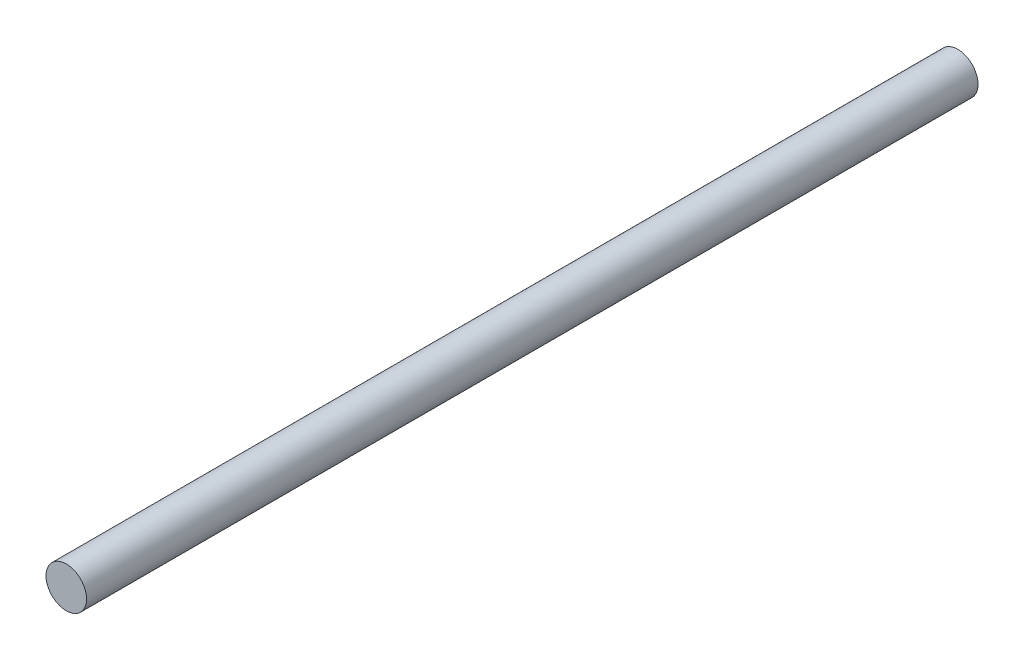
ISO-10303-21;
HEADER;
FILE_DESCRIPTION(('STEP AP214'),'2;1');
FILE_NAME('part.step','',(''),(''),'','','');
FILE_SCHEMA(('AUTOMOTIVE_DESIGN { 1 0 10303 214 1 1 1 1 }'));
ENDSEC;
DATA;
#1=APPLICATION_CONTEXT('core data for automotive mechanical design processes');
#2=APPLICATION_PROTOCOL_DEFINITION('international standard','automotive_design',2000,#1);
#3=PRODUCT_CONTEXT('',#1,'mechanical');
#4=PRODUCT('Part','Part','',(#3));
#5=PRODUCT_RELATED_PRODUCT_CATEGORY('part','',(#4));
#6=PRODUCT_DEFINITION_FORMATION('','',#4);
#7=PRODUCT_DEFINITION_CONTEXT('part definition',#1,'design');
#8=PRODUCT_DEFINITION('design','',#6,#7);
#9=PRODUCT_DEFINITION_SHAPE('','',#8);
#10=(LENGTH_UNIT() NAMED_UNIT(*) SI_UNIT(.MILLI.,.METRE.));
#11=(NAMED_UNIT(*) PLANE_ANGLE_UNIT() SI_UNIT($,.RADIAN.));
#12=(NAMED_UNIT(*) SI_UNIT($,.STERADIAN.) SOLID_ANGLE_UNIT());
#13=UNCERTAINTY_MEASURE_WITH_UNIT(LENGTH_MEASURE(1.E-05),#10,'distance_accuracy_value','');
#14=(GEOMETRIC_REPRESENTATION_CONTEXT(3) GLOBAL_UNCERTAINTY_ASSIGNED_CONTEXT((#13)) GLOBAL_UNIT_ASSIGNED_CONTEXT((#10,
#11,#12)) REPRESENTATION_CONTEXT('',''));
#15=CARTESIAN_POINT('',(0.,0.,0.));
#16=DIRECTION('',(0.,0.,1.));
#17=DIRECTION('',(1.,0.,0.));
#18=AXIS2_PLACEMENT_3D('',#15,#16,#17);
#19=CARTESIAN_POINT('',(0.,0.,249.));
#20=DIRECTION('',(0.,0.,1.));
#21=DIRECTION('',(1.,0.,0.));
#22=AXIS2_PLACEMENT_3D('',#19,#20,#21);
#23=PLANE('',#22);
#24=CARTESIAN_POINT('',(0.,0.,249.));
#25=DIRECTION('',(0.,0.,-1.));
#26=DIRECTION('',(-1.,0.,0.));
#27=AXIS2_PLACEMENT_3D('',#24,#25,#26);
#28=CIRCLE('',#27,5.665);
#29=CARTESIAN_POINT('',(-5.665,0.,249.));
#30=VERTEX_POINT('',#29);
#31=EDGE_CURVE('E17',#30,#30,#28,.T.);
#32=ORIENTED_EDGE('',*,*,#31,.F.);
#33=EDGE_LOOP('',(#32));
#34=FACE_BOUND('',#33,.T.);
#35=ADVANCED_FACE('F14',(#34),#23,.T.);
#36=CARTESIAN_POINT('',(0.,0.,0.));
#37=DIRECTION('',(0.,0.,1.));
#38=DIRECTION('',(1.,0.,0.));
#39=AXIS2_PLACEMENT_3D('',#36,#37,#38);
#40=PLANE('',#39);
#41=CARTESIAN_POINT('',(0.,0.,0.));
#42=DIRECTION('',(0.,0.,-1.));
#43=DIRECTION('',(-1.,0.,0.));
#44=AXIS2_PLACEMENT_3D('',#41,#42,#43);
#45=CIRCLE('',#44,5.665);
#46=CARTESIAN_POINT('',(-5.665,0.,0.));
#47=VERTEX_POINT('',#46);
#48=EDGE_CURVE('E10',#47,#47,#45,.F.);
#49=ORIENTED_EDGE('',*,*,#48,.F.);
#50=EDGE_LOOP('',(#49));
#51=FACE_BOUND('',#50,.T.);
#52=ADVANCED_FACE('F32',(#51),#40,.F.);
#53=CARTESIAN_POINT('',(0.,0.,249.));
#54=DIRECTION('',(0.,0.,-1.));
#55=DIRECTION('',(-1.,0.,0.));
#56=AXIS2_PLACEMENT_3D('',#53,#54,#55);
#57=CYLINDRICAL_SURFACE('',#56,5.665);
#58=ORIENTED_EDGE('',*,*,#48,.T.);
#59=EDGE_LOOP('',(#58));
#60=FACE_BOUND('',#59,.T.);
#61=ORIENTED_EDGE('',*,*,#31,.T.);
#62=EDGE_LOOP('',(#61));
#63=FACE_BOUND('',#62,.T.);
#64=ADVANCED_FACE('F29',(#60,#63),#57,.T.);
#65=CLOSED_SHELL('',(#35,#52,#64));
#66=MANIFOLD_SOLID_BREP('B1',#65);
#67=ADVANCED_BREP_SHAPE_REPRESENTATION('',(#18,#66),#14);
#68=SHAPE_DEFINITION_REPRESENTATION(#9,#67);
ENDSEC;
END-ISO-10303-21;
